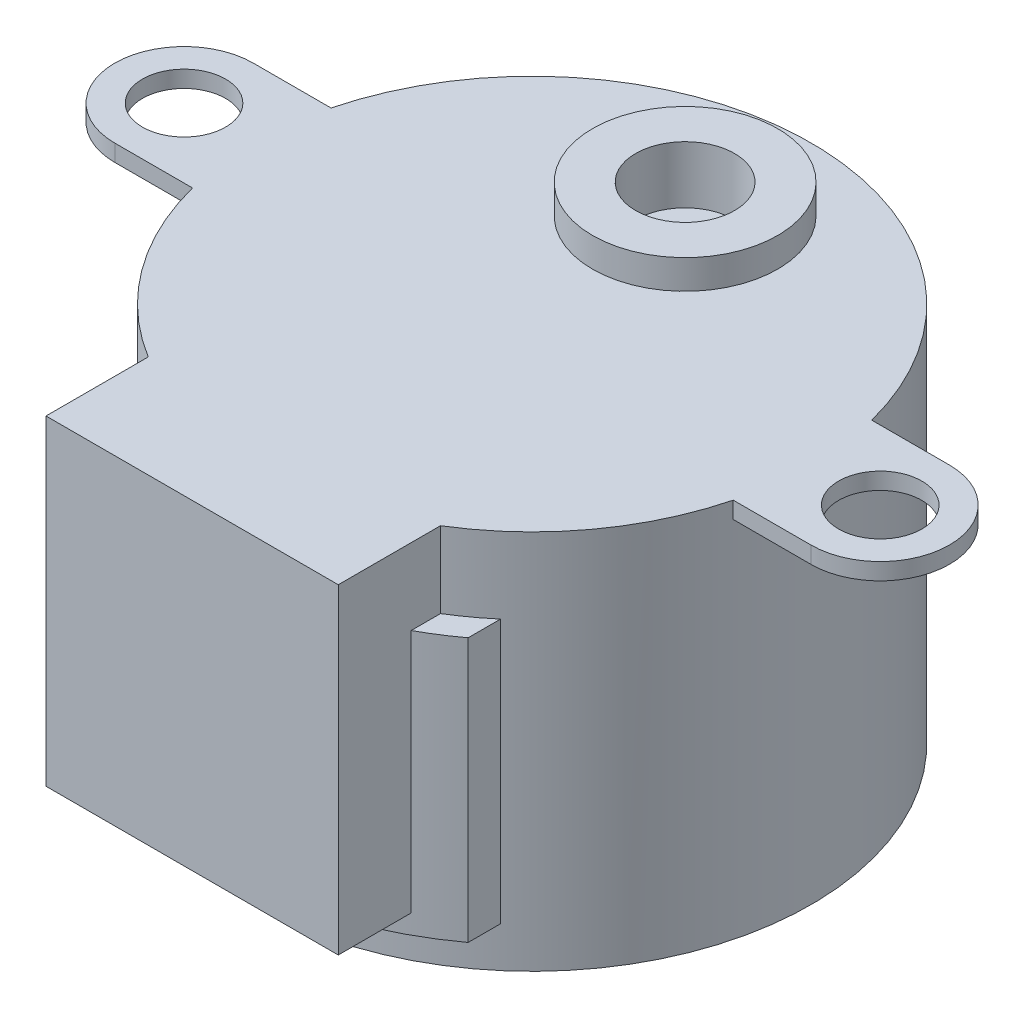
ISO-10303-21;
HEADER;
FILE_DESCRIPTION(('STEP AP214'),'2;1');
FILE_NAME('part.step','',(''),(''),'','','');
FILE_SCHEMA(('AUTOMOTIVE_DESIGN { 1 0 10303 214 1 1 1 1 }'));
ENDSEC;
DATA;
#1=APPLICATION_CONTEXT('core data for automotive mechanical design processes');
#2=APPLICATION_PROTOCOL_DEFINITION('international standard','automotive_design',2000,#1);
#3=PRODUCT_CONTEXT('',#1,'mechanical');
#4=PRODUCT('Part','Part','',(#3));
#5=PRODUCT_RELATED_PRODUCT_CATEGORY('part','',(#4));
#6=PRODUCT_DEFINITION_FORMATION('','',#4);
#7=PRODUCT_DEFINITION_CONTEXT('part definition',#1,'design');
#8=PRODUCT_DEFINITION('design','',#6,#7);
#9=PRODUCT_DEFINITION_SHAPE('','',#8);
#10=(LENGTH_UNIT() NAMED_UNIT(*) SI_UNIT(.MILLI.,.METRE.));
#11=(NAMED_UNIT(*) PLANE_ANGLE_UNIT() SI_UNIT($,.RADIAN.));
#12=(NAMED_UNIT(*) SI_UNIT($,.STERADIAN.) SOLID_ANGLE_UNIT());
#13=UNCERTAINTY_MEASURE_WITH_UNIT(LENGTH_MEASURE(1.E-05),#10,'distance_accuracy_value','');
#14=(GEOMETRIC_REPRESENTATION_CONTEXT(3) GLOBAL_UNCERTAINTY_ASSIGNED_CONTEXT((#13)) GLOBAL_UNIT_ASSIGNED_CONTEXT((#10,
#11,#12)) REPRESENTATION_CONTEXT('',''));
#15=CARTESIAN_POINT('',(0.,0.,0.));
#16=DIRECTION('',(0.,0.,1.));
#17=DIRECTION('',(1.,0.,0.));
#18=AXIS2_PLACEMENT_3D('',#15,#16,#17);
#19=CARTESIAN_POINT('',(0.,19.05,0.));
#20=DIRECTION('',(0.,-1.,0.));
#21=DIRECTION('',(0.,0.,-1.));
#22=AXIS2_PLACEMENT_3D('',#19,#20,#21);
#23=CYLINDRICAL_SURFACE('',#22,13.97);
#24=CARTESIAN_POINT('',(0.,0.,0.));
#25=DIRECTION('',(0.,1.,0.));
#26=DIRECTION('',(0.,0.,1.));
#27=AXIS2_PLACEMENT_3D('',#24,#25,#26);
#28=CIRCLE('',#27,13.97);
#29=CARTESIAN_POINT('',(0.,0.,13.97));
#30=VERTEX_POINT('',#29);
#31=EDGE_CURVE('E317',#30,#30,#28,.T.);
#32=ORIENTED_EDGE('',*,*,#31,.T.);
#33=EDGE_LOOP('',(#32));
#34=FACE_BOUND('',#33,.T.);
#35=CARTESIAN_POINT('',(0.,15.24,0.));
#36=DIRECTION('',(0.,-1.,0.));
#37=DIRECTION('',(0.,0.,-1.));
#38=AXIS2_PLACEMENT_3D('',#35,#36,#37);
#39=CIRCLE('',#38,13.97);
#40=CARTESIAN_POINT('',(9.0551,15.24,10.6379539381405));
#41=VERTEX_POINT('',#40);
#42=CARTESIAN_POINT('',(7.3152,15.24,11.9016279962029));
#43=VERTEX_POINT('',#42);
#44=EDGE_CURVE('E204',#41,#43,#39,.T.);
#45=ORIENTED_EDGE('',*,*,#44,.F.);
#46=DIRECTION('',(0.,1.,0.));
#47=VECTOR('',#46,1.);
#48=CARTESIAN_POINT('',(9.0551,2.032,10.6379539381405));
#49=LINE('',#48,#47);
#50=CARTESIAN_POINT('',(9.0551,2.032,10.6379539381405));
#51=VERTEX_POINT('',#50);
#52=EDGE_CURVE('E192',#51,#41,#49,.T.);
#53=ORIENTED_EDGE('',*,*,#52,.F.);
#54=CARTESIAN_POINT('',(0.,2.032,0.));
#55=DIRECTION('',(0.,-1.,0.));
#56=DIRECTION('',(0.,0.,-1.));
#57=AXIS2_PLACEMENT_3D('',#54,#55,#56);
#58=CIRCLE('',#57,13.97);
#59=CARTESIAN_POINT('',(-9.0551,2.032,10.6379539381405));
#60=VERTEX_POINT('',#59);
#61=EDGE_CURVE('E185',#51,#60,#58,.T.);
#62=ORIENTED_EDGE('',*,*,#61,.T.);
#63=DIRECTION('',(0.,1.,0.));
#64=VECTOR('',#63,1.);
#65=CARTESIAN_POINT('',(-9.0551,2.032,10.6379539381405));
#66=LINE('',#65,#64);
#67=CARTESIAN_POINT('',(-9.0551,15.24,10.6379539381405));
#68=VERTEX_POINT('',#67);
#69=EDGE_CURVE('E169',#60,#68,#66,.T.);
#70=ORIENTED_EDGE('',*,*,#69,.T.);
#71=CARTESIAN_POINT('',(-7.3152,15.24,11.9016279962029));
#72=VERTEX_POINT('',#71);
#73=EDGE_CURVE('E206',#72,#68,#39,.T.);
#74=ORIENTED_EDGE('',*,*,#73,.F.);
#75=DIRECTION('',(0.,1.,0.));
#76=VECTOR('',#75,1.);
#77=CARTESIAN_POINT('',(-7.3152,2.9972,11.9016279962029));
#78=LINE('',#77,#76);
#79=CARTESIAN_POINT('',(-7.3152,19.05,11.9016279962029));
#80=VERTEX_POINT('',#79);
#81=EDGE_CURVE('E239',#72,#80,#78,.T.);
#82=ORIENTED_EDGE('',*,*,#81,.T.);
#83=CARTESIAN_POINT('',(0.,19.05,0.));
#84=DIRECTION('',(0.,1.,0.));
#85=DIRECTION('',(0.,0.,1.));
#86=AXIS2_PLACEMENT_3D('',#83,#84,#85);
#87=CIRCLE('',#86,13.97);
#88=CARTESIAN_POINT('',(-13.5329271626651,19.05,3.4671));
#89=VERTEX_POINT('',#88);
#90=EDGE_CURVE('E320',#89,#80,#87,.T.);
#91=ORIENTED_EDGE('',*,*,#90,.F.);
#92=DIRECTION('',(0.,1.,0.));
#93=VECTOR('',#92,1.);
#94=CARTESIAN_POINT('',(-13.5329271626651,18.2118,3.4671));
#95=LINE('',#94,#93);
#96=CARTESIAN_POINT('',(-13.5329271626651,18.2118,3.4671));
#97=VERTEX_POINT('',#96);
#98=EDGE_CURVE('E310',#97,#89,#95,.T.);
#99=ORIENTED_EDGE('',*,*,#98,.F.);
#100=CARTESIAN_POINT('',(0.,18.2118,0.));
#101=DIRECTION('',(0.,1.,0.));
#102=DIRECTION('',(0.,0.,1.));
#103=AXIS2_PLACEMENT_3D('',#100,#101,#102);
#104=CIRCLE('',#103,13.97);
#105=CARTESIAN_POINT('',(-13.5329271626651,18.2118,-3.4671));
#106=VERTEX_POINT('',#105);
#107=EDGE_CURVE('E290',#106,#97,#104,.T.);
#108=ORIENTED_EDGE('',*,*,#107,.F.);
#109=DIRECTION('',(0.,1.,0.));
#110=VECTOR('',#109,1.);
#111=CARTESIAN_POINT('',(-13.5329271626651,18.2118,-3.4671));
#112=LINE('',#111,#110);
#113=CARTESIAN_POINT('',(-13.5329271626651,19.05,-3.4671));
#114=VERTEX_POINT('',#113);
#115=EDGE_CURVE('E307',#106,#114,#112,.T.);
#116=ORIENTED_EDGE('',*,*,#115,.T.);
#117=CARTESIAN_POINT('',(13.5329271626651,19.05,-3.4671));
#118=VERTEX_POINT('',#117);
#119=EDGE_CURVE('E324',#118,#114,#87,.T.);
#120=ORIENTED_EDGE('',*,*,#119,.F.);
#121=DIRECTION('',(0.,1.,0.));
#122=VECTOR('',#121,1.);
#123=CARTESIAN_POINT('',(13.5329271626651,18.2118,-3.4671));
#124=LINE('',#123,#122);
#125=CARTESIAN_POINT('',(13.5329271626651,18.2118,-3.4671));
#126=VERTEX_POINT('',#125);
#127=EDGE_CURVE('E270',#126,#118,#124,.T.);
#128=ORIENTED_EDGE('',*,*,#127,.F.);
#129=CARTESIAN_POINT('',(0.,18.2118,0.));
#130=DIRECTION('',(0.,1.,0.));
#131=DIRECTION('',(0.,0.,1.));
#132=AXIS2_PLACEMENT_3D('',#129,#130,#131);
#133=CIRCLE('',#132,13.97);
#134=CARTESIAN_POINT('',(13.5329271626651,18.2118,3.4671));
#135=VERTEX_POINT('',#134);
#136=EDGE_CURVE('E249',#135,#126,#133,.T.);
#137=ORIENTED_EDGE('',*,*,#136,.F.);
#138=DIRECTION('',(0.,1.,0.));
#139=VECTOR('',#138,1.);
#140=CARTESIAN_POINT('',(13.5329271626651,18.2118,3.4671));
#141=LINE('',#140,#139);
#142=CARTESIAN_POINT('',(13.5329271626651,19.05,3.4671));
#143=VERTEX_POINT('',#142);
#144=EDGE_CURVE('E260',#135,#143,#141,.T.);
#145=ORIENTED_EDGE('',*,*,#144,.T.);
#146=CARTESIAN_POINT('',(7.3152,19.05,11.9016279962029));
#147=VERTEX_POINT('',#146);
#148=EDGE_CURVE('E323',#147,#143,#87,.T.);
#149=ORIENTED_EDGE('',*,*,#148,.F.);
#150=DIRECTION('',(0.,1.,0.));
#151=VECTOR('',#150,1.);
#152=CARTESIAN_POINT('',(7.3152,2.9972,11.9016279962029));
#153=LINE('',#152,#151);
#154=EDGE_CURVE('E63',#43,#147,#153,.T.);
#155=ORIENTED_EDGE('',*,*,#154,.F.);
#156=EDGE_LOOP('',(#45,#53,#62,#70,#74,#82,#91,#99,#108,#116,#120,#128,#137,#145,#149,#155));
#157=FACE_BOUND('',#156,.T.);
#158=ADVANCED_FACE('F42',(#34,#157),#23,.T.);
#159=CARTESIAN_POINT('',(0.,19.05,0.));
#160=DIRECTION('',(0.,1.,0.));
#161=DIRECTION('',(0.,0.,1.));
#162=AXIS2_PLACEMENT_3D('',#159,#160,#161);
#163=PLANE('',#162);
#164=CARTESIAN_POINT('',(0.,19.05,-7.6581));
#165=DIRECTION('',(0.,1.,0.));
#166=DIRECTION('',(0.,0.,1.));
#167=AXIS2_PLACEMENT_3D('',#164,#165,#166);
#168=CIRCLE('',#167,4.6355);
#169=CARTESIAN_POINT('',(0.,19.05,-3.0226));
#170=VERTEX_POINT('',#169);
#171=EDGE_CURVE('E306',#170,#170,#168,.T.);
#172=ORIENTED_EDGE('',*,*,#171,.F.);
#173=EDGE_LOOP('',(#172));
#174=FACE_BOUND('',#173,.T.);
#175=ORIENTED_EDGE('',*,*,#90,.T.);
#176=DIRECTION('',(0.,0.,1.));
#177=VECTOR('',#176,1.);
#178=CARTESIAN_POINT('',(-7.3152,19.05,11.9016279962029));
#179=LINE('',#178,#177);
#180=CARTESIAN_POINT('',(-7.3152,19.05,17.018));
#181=VERTEX_POINT('',#180);
#182=EDGE_CURVE('E222',#80,#181,#179,.T.);
#183=ORIENTED_EDGE('',*,*,#182,.T.);
#184=DIRECTION('',(1.,0.,0.));
#185=VECTOR('',#184,1.);
#186=CARTESIAN_POINT('',(7.3152,19.05,17.018));
#187=LINE('',#186,#185);
#188=CARTESIAN_POINT('',(7.3152,19.05,17.018));
#189=VERTEX_POINT('',#188);
#190=EDGE_CURVE('E235',#181,#189,#187,.T.);
#191=ORIENTED_EDGE('',*,*,#190,.T.);
#192=DIRECTION('',(0.,0.,-1.));
#193=VECTOR('',#192,1.);
#194=CARTESIAN_POINT('',(7.3152,19.05,11.9016279962029));
#195=LINE('',#194,#193);
#196=EDGE_CURVE('E226',#189,#147,#195,.T.);
#197=ORIENTED_EDGE('',*,*,#196,.T.);
#198=ORIENTED_EDGE('',*,*,#148,.T.);
#199=DIRECTION('',(-1.,0.,0.));
#200=VECTOR('',#199,1.);
#201=CARTESIAN_POINT('',(0.,19.05,3.46710000000005));
#202=LINE('',#201,#200);
#203=CARTESIAN_POINT('',(17.4244,19.05,3.46709999999999));
#204=VERTEX_POINT('',#203);
#205=EDGE_CURVE('E263',#204,#143,#202,.T.);
#206=ORIENTED_EDGE('',*,*,#205,.F.);
#207=CARTESIAN_POINT('',(17.4244,19.05,0.));
#208=DIRECTION('',(0.,1.,0.));
#209=DIRECTION('',(0.,0.,1.));
#210=AXIS2_PLACEMENT_3D('',#207,#208,#209);
#211=CIRCLE('',#210,3.46709999999999);
#212=CARTESIAN_POINT('',(17.4244,19.05,-3.46709999999999));
#213=VERTEX_POINT('',#212);
#214=EDGE_CURVE('E266',#204,#213,#211,.T.);
#215=ORIENTED_EDGE('',*,*,#214,.T.);
#216=DIRECTION('',(-1.,0.,0.));
#217=VECTOR('',#216,1.);
#218=CARTESIAN_POINT('',(0.,19.05,-3.46710000000005));
#219=LINE('',#218,#217);
#220=EDGE_CURVE('E250',#213,#118,#219,.T.);
#221=ORIENTED_EDGE('',*,*,#220,.T.);
#222=ORIENTED_EDGE('',*,*,#119,.T.);
#223=DIRECTION('',(1.,0.,0.));
#224=VECTOR('',#223,1.);
#225=CARTESIAN_POINT('',(0.,19.05,-3.46710000000007));
#226=LINE('',#225,#224);
#227=CARTESIAN_POINT('',(-17.4244,19.05,-3.46709999999998));
#228=VERTEX_POINT('',#227);
#229=EDGE_CURVE('E284',#228,#114,#226,.T.);
#230=ORIENTED_EDGE('',*,*,#229,.F.);
#231=CARTESIAN_POINT('',(-17.4244,19.05,0.));
#232=DIRECTION('',(0.,1.,0.));
#233=DIRECTION('',(0.,0.,1.));
#234=AXIS2_PLACEMENT_3D('',#231,#232,#233);
#235=CIRCLE('',#234,3.46709999999999);
#236=CARTESIAN_POINT('',(-17.4244,19.05,3.46709999999999));
#237=VERTEX_POINT('',#236);
#238=EDGE_CURVE('E297',#228,#237,#235,.T.);
#239=ORIENTED_EDGE('',*,*,#238,.T.);
#240=DIRECTION('',(1.,0.,0.));
#241=VECTOR('',#240,1.);
#242=CARTESIAN_POINT('',(0.,19.05,3.46710000000002));
#243=LINE('',#242,#241);
#244=EDGE_CURVE('E300',#237,#89,#243,.T.);
#245=ORIENTED_EDGE('',*,*,#244,.T.);
#246=EDGE_LOOP('',(#175,#183,#191,#197,#198,#206,#215,#221,#222,#230,#239,#245));
#247=FACE_BOUND('',#246,.T.);
#248=CARTESIAN_POINT('',(-17.4244,19.05,0.));
#249=DIRECTION('',(0.,1.,0.));
#250=DIRECTION('',(0.,0.,1.));
#251=AXIS2_PLACEMENT_3D('',#248,#249,#250);
#252=CIRCLE('',#251,2.0828);
#253=CARTESIAN_POINT('',(-17.4244,19.05,2.0828));
#254=VERTEX_POINT('',#253);
#255=EDGE_CURVE('E273',#254,#254,#252,.T.);
#256=ORIENTED_EDGE('',*,*,#255,.F.);
#257=EDGE_LOOP('',(#256));
#258=FACE_BOUND('',#257,.T.);
#259=CARTESIAN_POINT('',(17.4244,19.05,0.));
#260=DIRECTION('',(0.,1.,0.));
#261=DIRECTION('',(0.,0.,1.));
#262=AXIS2_PLACEMENT_3D('',#259,#260,#261);
#263=CIRCLE('',#262,2.0828);
#264=CARTESIAN_POINT('',(17.4244,19.05,2.08279999999999));
#265=VERTEX_POINT('',#264);
#266=EDGE_CURVE('E241',#265,#265,#263,.T.);
#267=ORIENTED_EDGE('',*,*,#266,.F.);
#268=EDGE_LOOP('',(#267));
#269=FACE_BOUND('',#268,.T.);
#270=ADVANCED_FACE('F367',(#174,#247,#258,#269),#163,.T.);
#271=CARTESIAN_POINT('',(0.,0.,0.));
#272=DIRECTION('',(0.,1.,0.));
#273=DIRECTION('',(0.,0.,1.));
#274=AXIS2_PLACEMENT_3D('',#271,#272,#273);
#275=PLANE('',#274);
#276=ORIENTED_EDGE('',*,*,#31,.F.);
#277=EDGE_LOOP('',(#276));
#278=FACE_BOUND('',#277,.T.);
#279=ADVANCED_FACE('F374',(#278),#275,.F.);
#280=CARTESIAN_POINT('',(0.,20.5105,-7.6581));
#281=DIRECTION('',(0.,-1.,0.));
#282=DIRECTION('',(0.,0.,-1.));
#283=AXIS2_PLACEMENT_3D('',#280,#281,#282);
#284=CYLINDRICAL_SURFACE('',#283,4.6355);
#285=CARTESIAN_POINT('',(0.,20.5105,-7.6581));
#286=DIRECTION('',(0.,1.,0.));
#287=DIRECTION('',(0.,0.,1.));
#288=AXIS2_PLACEMENT_3D('',#285,#286,#287);
#289=CIRCLE('',#288,4.6355);
#290=CARTESIAN_POINT('',(0.,20.5105,-3.0226));
#291=VERTEX_POINT('',#290);
#292=EDGE_CURVE('E314',#291,#291,#289,.T.);
#293=ORIENTED_EDGE('',*,*,#292,.F.);
#294=EDGE_LOOP('',(#293));
#295=FACE_BOUND('',#294,.T.);
#296=ORIENTED_EDGE('',*,*,#171,.T.);
#297=EDGE_LOOP('',(#296));
#298=FACE_BOUND('',#297,.T.);
#299=ADVANCED_FACE('F380',(#295,#298),#284,.T.);
#300=CARTESIAN_POINT('',(0.,20.5105,-7.6581));
#301=DIRECTION('',(0.,1.,0.));
#302=DIRECTION('',(0.,0.,1.));
#303=AXIS2_PLACEMENT_3D('',#300,#301,#302);
#304=PLANE('',#303);
#305=CARTESIAN_POINT('',(0.,20.5105,-7.6581));
#306=DIRECTION('',(0.,1.,0.));
#307=DIRECTION('',(0.,0.,1.));
#308=AXIS2_PLACEMENT_3D('',#305,#306,#307);
#309=CIRCLE('',#308,2.4765);
#310=CARTESIAN_POINT('',(0.,20.5105,-5.1816));
#311=VERTEX_POINT('',#310);
#312=EDGE_CURVE('E199',#311,#311,#309,.T.);
#313=ORIENTED_EDGE('',*,*,#312,.F.);
#314=EDGE_LOOP('',(#313));
#315=FACE_BOUND('',#314,.T.);
#316=ORIENTED_EDGE('',*,*,#292,.T.);
#317=EDGE_LOOP('',(#316));
#318=FACE_BOUND('',#317,.T.);
#319=ADVANCED_FACE('F384',(#315,#318),#304,.T.);
#320=CARTESIAN_POINT('',(-17.4244,18.2118,0.));
#321=DIRECTION('',(0.,1.,0.));
#322=DIRECTION('',(0.,0.,1.));
#323=AXIS2_PLACEMENT_3D('',#320,#321,#322);
#324=CYLINDRICAL_SURFACE('',#323,3.46709999999999);
#325=ORIENTED_EDGE('',*,*,#238,.F.);
#326=DIRECTION('',(0.,1.,0.));
#327=VECTOR('',#326,1.);
#328=CARTESIAN_POINT('',(-17.4244,18.2118,-3.46709999999998));
#329=LINE('',#328,#327);
#330=CARTESIAN_POINT('',(-17.4244,18.2118,-3.46709999999998));
#331=VERTEX_POINT('',#330);
#332=EDGE_CURVE('E304',#331,#228,#329,.T.);
#333=ORIENTED_EDGE('',*,*,#332,.F.);
#334=CARTESIAN_POINT('',(-17.4244,18.2118,0.));
#335=DIRECTION('',(0.,1.,0.));
#336=DIRECTION('',(0.,0.,1.));
#337=AXIS2_PLACEMENT_3D('',#334,#335,#336);
#338=CIRCLE('',#337,3.46709999999999);
#339=CARTESIAN_POINT('',(-17.4244,18.2118,3.46709999999999));
#340=VERTEX_POINT('',#339);
#341=EDGE_CURVE('E283',#331,#340,#338,.T.);
#342=ORIENTED_EDGE('',*,*,#341,.T.);
#343=DIRECTION('',(0.,1.,0.));
#344=VECTOR('',#343,1.);
#345=CARTESIAN_POINT('',(-17.4244,18.2118,3.46709999999999));
#346=LINE('',#345,#344);
#347=EDGE_CURVE('E294',#340,#237,#346,.T.);
#348=ORIENTED_EDGE('',*,*,#347,.T.);
#349=EDGE_LOOP('',(#325,#333,#342,#348));
#350=FACE_BOUND('',#349,.T.);
#351=ADVANCED_FACE('F390',(#350),#324,.T.);
#352=CARTESIAN_POINT('',(0.,18.2118,-3.46710000000007));
#353=DIRECTION('',(0.,0.,1.));
#354=DIRECTION('',(1.,0.,0.));
#355=AXIS2_PLACEMENT_3D('',#352,#353,#354);
#356=PLANE('',#355);
#357=ORIENTED_EDGE('',*,*,#229,.T.);
#358=ORIENTED_EDGE('',*,*,#115,.F.);
#359=DIRECTION('',(1.,0.,0.));
#360=VECTOR('',#359,1.);
#361=CARTESIAN_POINT('',(0.,18.2118,-3.46710000000007));
#362=LINE('',#361,#360);
#363=EDGE_CURVE('E292',#331,#106,#362,.T.);
#364=ORIENTED_EDGE('',*,*,#363,.F.);
#365=ORIENTED_EDGE('',*,*,#332,.T.);
#366=EDGE_LOOP('',(#357,#358,#364,#365));
#367=FACE_BOUND('',#366,.T.);
#368=ADVANCED_FACE('F396',(#367),#356,.F.);
#369=CARTESIAN_POINT('',(-17.4244,18.2118,0.));
#370=DIRECTION('',(0.,1.,0.));
#371=DIRECTION('',(0.,0.,1.));
#372=AXIS2_PLACEMENT_3D('',#369,#370,#371);
#373=CYLINDRICAL_SURFACE('',#372,2.0828);
#374=CARTESIAN_POINT('',(-17.4244,18.2118,0.));
#375=DIRECTION('',(0.,1.,0.));
#376=DIRECTION('',(0.,0.,1.));
#377=AXIS2_PLACEMENT_3D('',#374,#375,#376);
#378=CIRCLE('',#377,2.0828);
#379=CARTESIAN_POINT('',(-17.4244,18.2118,2.0828));
#380=VERTEX_POINT('',#379);
#381=EDGE_CURVE('E280',#380,#380,#378,.T.);
#382=ORIENTED_EDGE('',*,*,#381,.F.);
#383=EDGE_LOOP('',(#382));
#384=FACE_BOUND('',#383,.T.);
#385=ORIENTED_EDGE('',*,*,#255,.T.);
#386=EDGE_LOOP('',(#385));
#387=FACE_BOUND('',#386,.T.);
#388=ADVANCED_FACE('F392',(#384,#387),#373,.F.);
#389=CARTESIAN_POINT('',(0.,18.2118,3.46710000000002));
#390=DIRECTION('',(0.,0.,1.));
#391=DIRECTION('',(1.,0.,0.));
#392=AXIS2_PLACEMENT_3D('',#389,#390,#391);
#393=PLANE('',#392);
#394=ORIENTED_EDGE('',*,*,#244,.F.);
#395=ORIENTED_EDGE('',*,*,#347,.F.);
#396=DIRECTION('',(1.,0.,0.));
#397=VECTOR('',#396,1.);
#398=CARTESIAN_POINT('',(0.,18.2118,3.46710000000002));
#399=LINE('',#398,#397);
#400=EDGE_CURVE('E287',#340,#97,#399,.T.);
#401=ORIENTED_EDGE('',*,*,#400,.T.);
#402=ORIENTED_EDGE('',*,*,#98,.T.);
#403=EDGE_LOOP('',(#394,#395,#401,#402));
#404=FACE_BOUND('',#403,.T.);
#405=ADVANCED_FACE('F395',(#404),#393,.T.);
#406=CARTESIAN_POINT('',(0.,18.2118,0.));
#407=DIRECTION('',(0.,1.,0.));
#408=DIRECTION('',(0.,0.,1.));
#409=AXIS2_PLACEMENT_3D('',#406,#407,#408);
#410=PLANE('',#409);
#411=ORIENTED_EDGE('',*,*,#381,.T.);
#412=EDGE_LOOP('',(#411));
#413=FACE_BOUND('',#412,.T.);
#414=ORIENTED_EDGE('',*,*,#341,.F.);
#415=ORIENTED_EDGE('',*,*,#363,.T.);
#416=ORIENTED_EDGE('',*,*,#107,.T.);
#417=ORIENTED_EDGE('',*,*,#400,.F.);
#418=EDGE_LOOP('',(#414,#415,#416,#417));
#419=FACE_BOUND('',#418,.T.);
#420=ADVANCED_FACE('F403',(#413,#419),#410,.F.);
#421=CARTESIAN_POINT('',(0.,18.2118,-3.46710000000005));
#422=DIRECTION('',(0.,0.,-1.));
#423=DIRECTION('',(-1.,0.,0.));
#424=AXIS2_PLACEMENT_3D('',#421,#422,#423);
#425=PLANE('',#424);
#426=ORIENTED_EDGE('',*,*,#220,.F.);
#427=DIRECTION('',(0.,1.,0.));
#428=VECTOR('',#427,1.);
#429=CARTESIAN_POINT('',(17.4244,18.2118,-3.46709999999999));
#430=LINE('',#429,#428);
#431=CARTESIAN_POINT('',(17.4244,18.2118,-3.46709999999999));
#432=VERTEX_POINT('',#431);
#433=EDGE_CURVE('E274',#432,#213,#430,.T.);
#434=ORIENTED_EDGE('',*,*,#433,.F.);
#435=DIRECTION('',(-1.,0.,0.));
#436=VECTOR('',#435,1.);
#437=CARTESIAN_POINT('',(0.,18.2118,-3.46710000000005));
#438=LINE('',#437,#436);
#439=EDGE_CURVE('E257',#432,#126,#438,.T.);
#440=ORIENTED_EDGE('',*,*,#439,.T.);
#441=ORIENTED_EDGE('',*,*,#127,.T.);
#442=EDGE_LOOP('',(#426,#434,#440,#441));
#443=FACE_BOUND('',#442,.T.);
#444=ADVANCED_FACE('F410',(#443),#425,.T.);
#445=CARTESIAN_POINT('',(17.4244,18.2118,0.));
#446=DIRECTION('',(0.,1.,0.));
#447=DIRECTION('',(0.,0.,1.));
#448=AXIS2_PLACEMENT_3D('',#445,#446,#447);
#449=CYLINDRICAL_SURFACE('',#448,3.46709999999999);
#450=ORIENTED_EDGE('',*,*,#214,.F.);
#451=DIRECTION('',(0.,1.,0.));
#452=VECTOR('',#451,1.);
#453=CARTESIAN_POINT('',(17.4244,18.2118,3.46709999999999));
#454=LINE('',#453,#452);
#455=CARTESIAN_POINT('',(17.4244,18.2118,3.46709999999999));
#456=VERTEX_POINT('',#455);
#457=EDGE_CURVE('E276',#456,#204,#454,.T.);
#458=ORIENTED_EDGE('',*,*,#457,.F.);
#459=CARTESIAN_POINT('',(17.4244,18.2118,0.));
#460=DIRECTION('',(0.,1.,0.));
#461=DIRECTION('',(0.,0.,1.));
#462=AXIS2_PLACEMENT_3D('',#459,#460,#461);
#463=CIRCLE('',#462,3.46709999999999);
#464=EDGE_CURVE('E254',#456,#432,#463,.T.);
#465=ORIENTED_EDGE('',*,*,#464,.T.);
#466=ORIENTED_EDGE('',*,*,#433,.T.);
#467=EDGE_LOOP('',(#450,#458,#465,#466));
#468=FACE_BOUND('',#467,.T.);
#469=ADVANCED_FACE('F416',(#468),#449,.T.);
#470=CARTESIAN_POINT('',(17.4244,18.2118,0.));
#471=DIRECTION('',(0.,1.,0.));
#472=DIRECTION('',(0.,0.,1.));
#473=AXIS2_PLACEMENT_3D('',#470,#471,#472);
#474=CYLINDRICAL_SURFACE('',#473,2.0828);
#475=CARTESIAN_POINT('',(17.4244,18.2118,0.));
#476=DIRECTION('',(0.,1.,0.));
#477=DIRECTION('',(0.,0.,1.));
#478=AXIS2_PLACEMENT_3D('',#475,#476,#477);
#479=CIRCLE('',#478,2.0828);
#480=CARTESIAN_POINT('',(17.4244,18.2118,2.08279999999999));
#481=VERTEX_POINT('',#480);
#482=EDGE_CURVE('E246',#481,#481,#479,.T.);
#483=ORIENTED_EDGE('',*,*,#482,.F.);
#484=EDGE_LOOP('',(#483));
#485=FACE_BOUND('',#484,.T.);
#486=ORIENTED_EDGE('',*,*,#266,.T.);
#487=EDGE_LOOP('',(#486));
#488=FACE_BOUND('',#487,.T.);
#489=ADVANCED_FACE('F412',(#485,#488),#474,.F.);
#490=CARTESIAN_POINT('',(0.,18.2118,3.46710000000005));
#491=DIRECTION('',(0.,0.,-1.));
#492=DIRECTION('',(-1.,0.,0.));
#493=AXIS2_PLACEMENT_3D('',#490,#491,#492);
#494=PLANE('',#493);
#495=ORIENTED_EDGE('',*,*,#205,.T.);
#496=ORIENTED_EDGE('',*,*,#144,.F.);
#497=DIRECTION('',(-1.,0.,0.));
#498=VECTOR('',#497,1.);
#499=CARTESIAN_POINT('',(0.,18.2118,3.46710000000005));
#500=LINE('',#499,#498);
#501=EDGE_CURVE('E252',#456,#135,#500,.T.);
#502=ORIENTED_EDGE('',*,*,#501,.F.);
#503=ORIENTED_EDGE('',*,*,#457,.T.);
#504=EDGE_LOOP('',(#495,#496,#502,#503));
#505=FACE_BOUND('',#504,.T.);
#506=ADVANCED_FACE('F415',(#505),#494,.F.);
#507=CARTESIAN_POINT('',(0.,18.2118,0.));
#508=DIRECTION('',(0.,1.,0.));
#509=DIRECTION('',(0.,0.,1.));
#510=AXIS2_PLACEMENT_3D('',#507,#508,#509);
#511=PLANE('',#510);
#512=ORIENTED_EDGE('',*,*,#482,.T.);
#513=EDGE_LOOP('',(#512));
#514=FACE_BOUND('',#513,.T.);
#515=ORIENTED_EDGE('',*,*,#136,.T.);
#516=ORIENTED_EDGE('',*,*,#439,.F.);
#517=ORIENTED_EDGE('',*,*,#464,.F.);
#518=ORIENTED_EDGE('',*,*,#501,.T.);
#519=EDGE_LOOP('',(#515,#516,#517,#518));
#520=FACE_BOUND('',#519,.T.);
#521=ADVANCED_FACE('F420',(#514,#520),#511,.F.);
#522=CARTESIAN_POINT('',(-7.3152,2.9972,11.9016279962029));
#523=DIRECTION('',(-1.,0.,0.));
#524=DIRECTION('',(0.,0.,1.));
#525=AXIS2_PLACEMENT_3D('',#522,#523,#524);
#526=PLANE('',#525);
#527=DIRECTION('',(0.,1.,0.));
#528=VECTOR('',#527,1.);
#529=CARTESIAN_POINT('',(-7.3152,2.032,13.3695717567916));
#530=LINE('',#529,#528);
#531=CARTESIAN_POINT('',(-7.3152,2.9972,13.3695717567916));
#532=VERTEX_POINT('',#531);
#533=CARTESIAN_POINT('',(-7.3152,15.24,13.3695717567916));
#534=VERTEX_POINT('',#533);
#535=EDGE_CURVE('E217',#532,#534,#530,.T.);
#536=ORIENTED_EDGE('',*,*,#535,.F.);
#537=DIRECTION('',(0.,0.,1.));
#538=VECTOR('',#537,1.);
#539=CARTESIAN_POINT('',(-7.3152,2.9972,11.9016279962029));
#540=LINE('',#539,#538);
#541=CARTESIAN_POINT('',(-7.3152,2.9972,17.018));
#542=VERTEX_POINT('',#541);
#543=EDGE_CURVE('E223',#532,#542,#540,.T.);
#544=ORIENTED_EDGE('',*,*,#543,.T.);
#545=DIRECTION('',(0.,1.,0.));
#546=VECTOR('',#545,1.);
#547=CARTESIAN_POINT('',(-7.3152,2.9972,17.018));
#548=LINE('',#547,#546);
#549=EDGE_CURVE('E232',#542,#181,#548,.T.);
#550=ORIENTED_EDGE('',*,*,#549,.T.);
#551=ORIENTED_EDGE('',*,*,#182,.F.);
#552=ORIENTED_EDGE('',*,*,#81,.F.);
#553=DIRECTION('',(0.,0.,1.));
#554=VECTOR('',#553,1.);
#555=CARTESIAN_POINT('',(-7.3152,15.24,11.9016279962029));
#556=LINE('',#555,#554);
#557=EDGE_CURVE('E219',#72,#534,#556,.T.);
#558=ORIENTED_EDGE('',*,*,#557,.T.);
#559=EDGE_LOOP('',(#536,#544,#550,#551,#552,#558));
#560=FACE_BOUND('',#559,.T.);
#561=ADVANCED_FACE('F339',(#560),#526,.T.);
#562=CARTESIAN_POINT('',(7.3152,2.9972,11.9016279962029));
#563=DIRECTION('',(1.,0.,0.));
#564=DIRECTION('',(0.,0.,-1.));
#565=AXIS2_PLACEMENT_3D('',#562,#563,#564);
#566=PLANE('',#565);
#567=DIRECTION('',(0.,1.,0.));
#568=VECTOR('',#567,1.);
#569=CARTESIAN_POINT('',(7.3152,2.032,13.3695717567916));
#570=LINE('',#569,#568);
#571=CARTESIAN_POINT('',(7.3152,15.24,13.3695717567916));
#572=VERTEX_POINT('',#571);
#573=CARTESIAN_POINT('',(7.3152,2.9972,13.3695717567916));
#574=VERTEX_POINT('',#573);
#575=EDGE_CURVE('E56',#572,#574,#570,.F.);
#576=ORIENTED_EDGE('',*,*,#575,.F.);
#577=DIRECTION('',(0.,0.,-1.));
#578=VECTOR('',#577,1.);
#579=CARTESIAN_POINT('',(7.3152,15.24,11.9016279962029));
#580=LINE('',#579,#578);
#581=EDGE_CURVE('E11',#572,#43,#580,.T.);
#582=ORIENTED_EDGE('',*,*,#581,.T.);
#583=ORIENTED_EDGE('',*,*,#154,.T.);
#584=ORIENTED_EDGE('',*,*,#196,.F.);
#585=DIRECTION('',(0.,1.,0.));
#586=VECTOR('',#585,1.);
#587=CARTESIAN_POINT('',(7.3152,2.9972,17.018));
#588=LINE('',#587,#586);
#589=CARTESIAN_POINT('',(7.3152,2.9972,17.018));
#590=VERTEX_POINT('',#589);
#591=EDGE_CURVE('E243',#590,#189,#588,.T.);
#592=ORIENTED_EDGE('',*,*,#591,.F.);
#593=DIRECTION('',(0.,0.,-1.));
#594=VECTOR('',#593,1.);
#595=CARTESIAN_POINT('',(7.3152,2.9972,11.9016279962029));
#596=LINE('',#595,#594);
#597=EDGE_CURVE('E229',#590,#574,#596,.T.);
#598=ORIENTED_EDGE('',*,*,#597,.T.);
#599=EDGE_LOOP('',(#576,#582,#583,#584,#592,#598));
#600=FACE_BOUND('',#599,.T.);
#601=ADVANCED_FACE('F332',(#600),#566,.T.);
#602=CARTESIAN_POINT('',(7.3152,2.9972,17.018));
#603=DIRECTION('',(0.,0.,1.));
#604=DIRECTION('',(1.,0.,0.));
#605=AXIS2_PLACEMENT_3D('',#602,#603,#604);
#606=PLANE('',#605);
#607=ORIENTED_EDGE('',*,*,#190,.F.);
#608=ORIENTED_EDGE('',*,*,#549,.F.);
#609=DIRECTION('',(1.,0.,0.));
#610=VECTOR('',#609,1.);
#611=CARTESIAN_POINT('',(7.3152,2.9972,17.018));
#612=LINE('',#611,#610);
#613=EDGE_CURVE('E225',#542,#590,#612,.T.);
#614=ORIENTED_EDGE('',*,*,#613,.T.);
#615=ORIENTED_EDGE('',*,*,#591,.T.);
#616=EDGE_LOOP('',(#607,#608,#614,#615));
#617=FACE_BOUND('',#616,.T.);
#618=ADVANCED_FACE('F335',(#617),#606,.T.);
#619=CARTESIAN_POINT('',(0.,2.9972,0.));
#620=DIRECTION('',(0.,1.,0.));
#621=DIRECTION('',(0.,0.,1.));
#622=AXIS2_PLACEMENT_3D('',#619,#620,#621);
#623=PLANE('',#622);
#624=ORIENTED_EDGE('',*,*,#543,.F.);
#625=CARTESIAN_POINT('',(0.,2.9972,0.));
#626=DIRECTION('',(0.,1.,0.));
#627=DIRECTION('',(0.,0.,1.));
#628=AXIS2_PLACEMENT_3D('',#625,#626,#627);
#629=CIRCLE('',#628,15.24);
#630=EDGE_CURVE('E49',#532,#574,#629,.T.);
#631=ORIENTED_EDGE('',*,*,#630,.T.);
#632=ORIENTED_EDGE('',*,*,#597,.F.);
#633=ORIENTED_EDGE('',*,*,#613,.F.);
#634=EDGE_LOOP('',(#624,#631,#632,#633));
#635=FACE_BOUND('',#634,.T.);
#636=ADVANCED_FACE('F329',(#635),#623,.F.);
#637=CARTESIAN_POINT('',(0.,15.24,0.));
#638=DIRECTION('',(0.,-1.,0.));
#639=DIRECTION('',(0.,0.,-1.));
#640=AXIS2_PLACEMENT_3D('',#637,#638,#639);
#641=PLANE('',#640);
#642=ORIENTED_EDGE('',*,*,#557,.F.);
#643=ORIENTED_EDGE('',*,*,#73,.T.);
#644=DIRECTION('',(0.,0.,1.));
#645=VECTOR('',#644,1.);
#646=CARTESIAN_POINT('',(-9.0551,15.24,10.6379539381405));
#647=LINE('',#646,#645);
#648=CARTESIAN_POINT('',(-9.0551,15.24,12.2581713150861));
#649=VERTEX_POINT('',#648);
#650=EDGE_CURVE('E174',#68,#649,#647,.T.);
#651=ORIENTED_EDGE('',*,*,#650,.T.);
#652=CARTESIAN_POINT('',(0.,15.24,0.));
#653=DIRECTION('',(0.,1.,0.));
#654=DIRECTION('',(0.,0.,-1.));
#655=AXIS2_PLACEMENT_3D('',#652,#653,#654);
#656=CIRCLE('',#655,15.24);
#657=EDGE_CURVE('E196',#649,#534,#656,.T.);
#658=ORIENTED_EDGE('',*,*,#657,.T.);
#659=EDGE_LOOP('',(#642,#643,#651,#658));
#660=FACE_BOUND('',#659,.T.);
#661=ADVANCED_FACE('F344',(#660),#641,.F.);
#662=CARTESIAN_POINT('',(9.0551,2.032,10.6379539381405));
#663=DIRECTION('',(1.,0.,0.));
#664=DIRECTION('',(0.,0.,-1.));
#665=AXIS2_PLACEMENT_3D('',#662,#663,#664);
#666=PLANE('',#665);
#667=DIRECTION('',(0.,0.,-1.));
#668=VECTOR('',#667,1.);
#669=CARTESIAN_POINT('',(9.0551,15.24,10.6379539381405));
#670=LINE('',#669,#668);
#671=CARTESIAN_POINT('',(9.0551,15.24,12.2581713150861));
#672=VERTEX_POINT('',#671);
#673=EDGE_CURVE('E193',#672,#41,#670,.T.);
#674=ORIENTED_EDGE('',*,*,#673,.F.);
#675=DIRECTION('',(0.,1.,0.));
#676=VECTOR('',#675,1.);
#677=CARTESIAN_POINT('',(9.0551,2.032,12.2581713150861));
#678=LINE('',#677,#676);
#679=CARTESIAN_POINT('',(9.0551,2.032,12.2581713150861));
#680=VERTEX_POINT('',#679);
#681=EDGE_CURVE('E212',#680,#672,#678,.T.);
#682=ORIENTED_EDGE('',*,*,#681,.F.);
#683=DIRECTION('',(0.,0.,-1.));
#684=VECTOR('',#683,1.);
#685=CARTESIAN_POINT('',(9.0551,2.032,10.6379539381405));
#686=LINE('',#685,#684);
#687=EDGE_CURVE('E179',#680,#51,#686,.T.);
#688=ORIENTED_EDGE('',*,*,#687,.T.);
#689=ORIENTED_EDGE('',*,*,#52,.T.);
#690=EDGE_LOOP('',(#674,#682,#688,#689));
#691=FACE_BOUND('',#690,.T.);
#692=ADVANCED_FACE('F441',(#691),#666,.T.);
#693=CARTESIAN_POINT('',(0.,2.032,0.));
#694=DIRECTION('',(0.,1.,0.));
#695=DIRECTION('',(0.,0.,1.));
#696=AXIS2_PLACEMENT_3D('',#693,#694,#695);
#697=CYLINDRICAL_SURFACE('',#696,15.24);
#698=ORIENTED_EDGE('',*,*,#630,.F.);
#699=ORIENTED_EDGE('',*,*,#535,.T.);
#700=ORIENTED_EDGE('',*,*,#657,.F.);
#701=DIRECTION('',(0.,1.,0.));
#702=VECTOR('',#701,1.);
#703=CARTESIAN_POINT('',(-9.0551,2.032,12.2581713150861));
#704=LINE('',#703,#702);
#705=CARTESIAN_POINT('',(-9.0551,2.032,12.2581713150861));
#706=VERTEX_POINT('',#705);
#707=EDGE_CURVE('E178',#706,#649,#704,.T.);
#708=ORIENTED_EDGE('',*,*,#707,.F.);
#709=CARTESIAN_POINT('',(0.,2.032,0.));
#710=DIRECTION('',(0.,1.,0.));
#711=DIRECTION('',(0.,0.,-1.));
#712=AXIS2_PLACEMENT_3D('',#709,#710,#711);
#713=CIRCLE('',#712,15.24);
#714=EDGE_CURVE('E188',#706,#680,#713,.T.);
#715=ORIENTED_EDGE('',*,*,#714,.T.);
#716=ORIENTED_EDGE('',*,*,#681,.T.);
#717=EDGE_CURVE('E208',#572,#672,#656,.T.);
#718=ORIENTED_EDGE('',*,*,#717,.F.);
#719=ORIENTED_EDGE('',*,*,#575,.T.);
#720=EDGE_LOOP('',(#698,#699,#700,#708,#715,#716,#718,#719));
#721=FACE_BOUND('',#720,.T.);
#722=ADVANCED_FACE('F342',(#721),#697,.T.);
#723=CARTESIAN_POINT('',(-9.0551,2.032,10.6379539381405));
#724=DIRECTION('',(-1.,0.,0.));
#725=DIRECTION('',(0.,0.,1.));
#726=AXIS2_PLACEMENT_3D('',#723,#724,#725);
#727=PLANE('',#726);
#728=ORIENTED_EDGE('',*,*,#650,.F.);
#729=ORIENTED_EDGE('',*,*,#69,.F.);
#730=DIRECTION('',(0.,0.,1.));
#731=VECTOR('',#730,1.);
#732=CARTESIAN_POINT('',(-9.0551,2.032,10.6379539381405));
#733=LINE('',#732,#731);
#734=EDGE_CURVE('E172',#60,#706,#733,.T.);
#735=ORIENTED_EDGE('',*,*,#734,.T.);
#736=ORIENTED_EDGE('',*,*,#707,.T.);
#737=EDGE_LOOP('',(#728,#729,#735,#736));
#738=FACE_BOUND('',#737,.T.);
#739=ADVANCED_FACE('F171',(#738),#727,.T.);
#740=CARTESIAN_POINT('',(0.,2.032,0.));
#741=DIRECTION('',(0.,-1.,0.));
#742=DIRECTION('',(0.,0.,-1.));
#743=AXIS2_PLACEMENT_3D('',#740,#741,#742);
#744=PLANE('',#743);
#745=ORIENTED_EDGE('',*,*,#61,.F.);
#746=ORIENTED_EDGE('',*,*,#687,.F.);
#747=ORIENTED_EDGE('',*,*,#714,.F.);
#748=ORIENTED_EDGE('',*,*,#734,.F.);
#749=EDGE_LOOP('',(#745,#746,#747,#748));
#750=FACE_BOUND('',#749,.T.);
#751=ADVANCED_FACE('F183',(#750),#744,.T.);
#752=ORIENTED_EDGE('',*,*,#581,.F.);
#753=ORIENTED_EDGE('',*,*,#717,.T.);
#754=ORIENTED_EDGE('',*,*,#673,.T.);
#755=ORIENTED_EDGE('',*,*,#44,.T.);
#756=EDGE_LOOP('',(#752,#753,#754,#755));
#757=FACE_BOUND('',#756,.T.);
#758=ADVANCED_FACE('F356',(#757),#641,.F.);
#759=CARTESIAN_POINT('',(0.,17.6403,-7.6581));
#760=DIRECTION('',(0.,1.,0.));
#761=DIRECTION('',(0.,0.,1.));
#762=AXIS2_PLACEMENT_3D('',#759,#760,#761);
#763=CYLINDRICAL_SURFACE('',#762,2.4765);
#764=ORIENTED_EDGE('',*,*,#312,.T.);
#765=EDGE_LOOP('',(#764));
#766=FACE_BOUND('',#765,.T.);
#767=CARTESIAN_POINT('',(0.,17.6403,-7.6581));
#768=DIRECTION('',(0.,1.,0.));
#769=DIRECTION('',(0.,0.,1.));
#770=AXIS2_PLACEMENT_3D('',#767,#768,#769);
#771=CIRCLE('',#770,2.4765);
#772=CARTESIAN_POINT('',(0.,17.6403,-5.1816));
#773=VERTEX_POINT('',#772);
#774=EDGE_CURVE('E346',#773,#773,#771,.T.);
#775=ORIENTED_EDGE('',*,*,#774,.F.);
#776=EDGE_LOOP('',(#775));
#777=FACE_BOUND('',#776,.T.);
#778=ADVANCED_FACE('F354',(#766,#777),#763,.F.);
#779=CARTESIAN_POINT('',(0.,17.6403,-7.6581));
#780=DIRECTION('',(0.,1.,0.));
#781=DIRECTION('',(0.,0.,1.));
#782=AXIS2_PLACEMENT_3D('',#779,#780,#781);
#783=PLANE('',#782);
#784=ORIENTED_EDGE('',*,*,#774,.T.);
#785=EDGE_LOOP('',(#784));
#786=FACE_BOUND('',#785,.T.);
#787=ADVANCED_FACE('F352',(#786),#783,.T.);
#788=CLOSED_SHELL('',(#158,#270,#279,#299,#319,#351,#368,#388,#405,#420,#444,#469,#489,#506,
#521,#561,#601,#618,#636,#661,#692,#722,#739,#751,#758,#778,#787));
#789=MANIFOLD_SOLID_BREP('B2',#788);
#790=ADVANCED_BREP_SHAPE_REPRESENTATION('',(#18,#789),#14);
#791=SHAPE_DEFINITION_REPRESENTATION(#9,#790);
ENDSEC;
END-ISO-10303-21;
